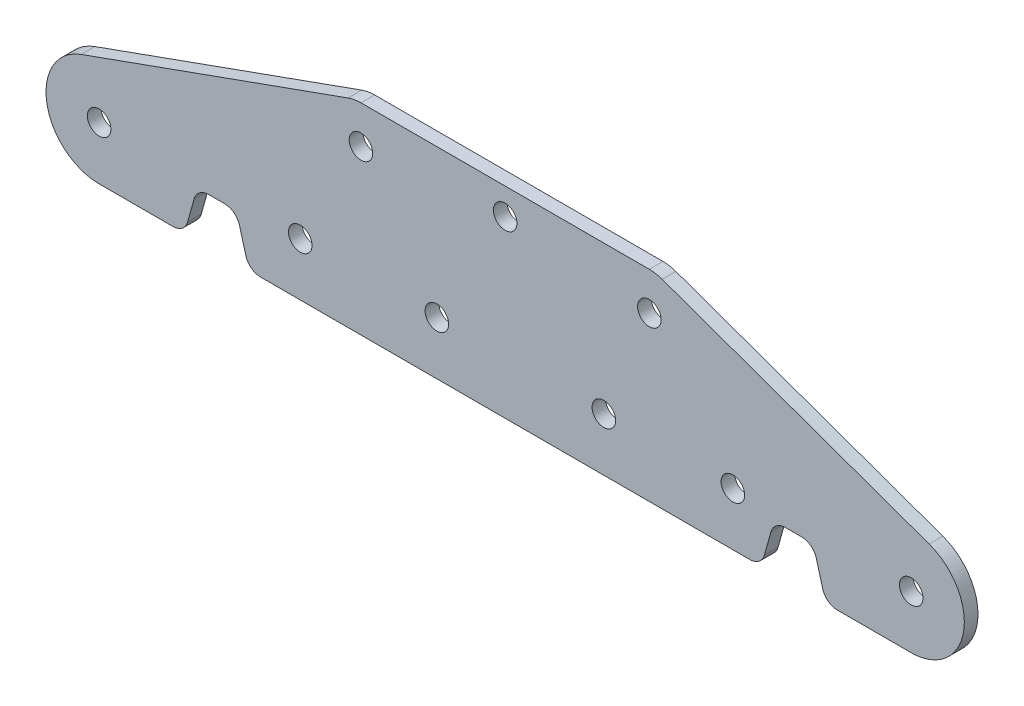
ISO-10303-21;
HEADER;
FILE_DESCRIPTION(('STEP AP214'),'2;1');
FILE_NAME('part.step','',(''),(''),'','','');
FILE_SCHEMA(('AUTOMOTIVE_DESIGN { 1 0 10303 214 1 1 1 1 }'));
ENDSEC;
DATA;
#1=APPLICATION_CONTEXT('core data for automotive mechanical design processes');
#2=APPLICATION_PROTOCOL_DEFINITION('international standard','automotive_design',2000,#1);
#3=PRODUCT_CONTEXT('',#1,'mechanical');
#4=PRODUCT('Part','Part','',(#3));
#5=PRODUCT_RELATED_PRODUCT_CATEGORY('part','',(#4));
#6=PRODUCT_DEFINITION_FORMATION('','',#4);
#7=PRODUCT_DEFINITION_CONTEXT('part definition',#1,'design');
#8=PRODUCT_DEFINITION('design','',#6,#7);
#9=PRODUCT_DEFINITION_SHAPE('','',#8);
#10=(LENGTH_UNIT() NAMED_UNIT(*) SI_UNIT(.MILLI.,.METRE.));
#11=(NAMED_UNIT(*) PLANE_ANGLE_UNIT() SI_UNIT($,.RADIAN.));
#12=(NAMED_UNIT(*) SI_UNIT($,.STERADIAN.) SOLID_ANGLE_UNIT());
#13=UNCERTAINTY_MEASURE_WITH_UNIT(LENGTH_MEASURE(1.E-05),#10,'distance_accuracy_value','');
#14=(GEOMETRIC_REPRESENTATION_CONTEXT(3) GLOBAL_UNCERTAINTY_ASSIGNED_CONTEXT((#13)) GLOBAL_UNIT_ASSIGNED_CONTEXT((#10,
#11,#12)) REPRESENTATION_CONTEXT('',''));
#15=CARTESIAN_POINT('',(0.,0.,0.));
#16=DIRECTION('',(0.,0.,1.));
#17=DIRECTION('',(1.,0.,0.));
#18=AXIS2_PLACEMENT_3D('',#15,#16,#17);
#19=CARTESIAN_POINT('',(5.60213228797349,15.617781870435,1.8));
#20=DIRECTION('',(0.33763778742634,0.941276114910947,0.));
#21=DIRECTION('',(-0.941276114910947,0.33763778742634,0.));
#22=AXIS2_PLACEMENT_3D('',#19,#20,#21);
#23=PLANE('',#22);
#24=DIRECTION('',(0.941276114910947,-0.33763778742634,0.));
#25=VECTOR('',#24,1.);
#26=CARTESIAN_POINT('',(5.60213228797349,15.617781870435,0.));
#27=LINE('',#26,#25);
#28=CARTESIAN_POINT('',(20.6881889371317,10.2063805745547,0.));
#29=VERTEX_POINT('',#28);
#30=CARTESIAN_POINT('',(55.8634645119844,-2.41106719562335,0.));
#31=VERTEX_POINT('',#30);
#32=EDGE_CURVE('E207',#29,#31,#27,.T.);
#33=ORIENTED_EDGE('',*,*,#32,.F.);
#34=DIRECTION('',(0.,0.,-1.));
#35=VECTOR('',#34,1.);
#36=CARTESIAN_POINT('',(20.6881889371317,10.2063805745547,1.8));
#37=LINE('',#36,#35);
#38=CARTESIAN_POINT('',(20.6881889371317,10.2063805745547,1.8));
#39=VERTEX_POINT('',#38);
#40=EDGE_CURVE('E201',#39,#29,#37,.T.);
#41=ORIENTED_EDGE('',*,*,#40,.F.);
#42=DIRECTION('',(0.941276114910947,-0.33763778742634,0.));
#43=VECTOR('',#42,1.);
#44=CARTESIAN_POINT('',(5.60213228797349,15.617781870435,1.8));
#45=LINE('',#44,#43);
#46=CARTESIAN_POINT('',(55.8634645119844,-2.41106719562335,1.8));
#47=VERTEX_POINT('',#46);
#48=EDGE_CURVE('E204',#39,#47,#45,.T.);
#49=ORIENTED_EDGE('',*,*,#48,.T.);
#50=DIRECTION('',(0.,0.,-1.));
#51=VECTOR('',#50,1.);
#52=CARTESIAN_POINT('',(55.8634645119844,-2.41106719562335,1.8));
#53=LINE('',#52,#51);
#54=EDGE_CURVE('E268',#47,#31,#53,.T.);
#55=ORIENTED_EDGE('',*,*,#54,.T.);
#56=EDGE_LOOP('',(#33,#41,#49,#55));
#57=FACE_BOUND('',#56,.T.);
#58=ADVANCED_FACE('F39',(#57),#23,.T.);
#59=CARTESIAN_POINT('',(19.,5.50000000000001,1.8));
#60=DIRECTION('',(0.,0.,-1.));
#61=DIRECTION('',(-1.,0.,0.));
#62=AXIS2_PLACEMENT_3D('',#59,#60,#61);
#63=CYLINDRICAL_SURFACE('',#62,5.);
#64=CARTESIAN_POINT('',(19.,5.50000000000001,0.));
#65=DIRECTION('',(0.,0.,1.));
#66=DIRECTION('',(1.,0.,0.));
#67=AXIS2_PLACEMENT_3D('',#64,#65,#66);
#68=CIRCLE('',#67,5.);
#69=CARTESIAN_POINT('',(19.,10.5,0.));
#70=VERTEX_POINT('',#69);
#71=EDGE_CURVE('E297',#29,#70,#68,.T.);
#72=ORIENTED_EDGE('',*,*,#71,.T.);
#73=DIRECTION('',(0.,0.,-1.));
#74=VECTOR('',#73,1.);
#75=CARTESIAN_POINT('',(19.,10.5,1.8));
#76=LINE('',#75,#74);
#77=CARTESIAN_POINT('',(19.,10.5,1.8));
#78=VERTEX_POINT('',#77);
#79=EDGE_CURVE('E212',#78,#70,#76,.T.);
#80=ORIENTED_EDGE('',*,*,#79,.F.);
#81=CARTESIAN_POINT('',(19.,5.50000000000001,1.8));
#82=DIRECTION('',(0.,0.,1.));
#83=DIRECTION('',(1.,0.,0.));
#84=AXIS2_PLACEMENT_3D('',#81,#82,#83);
#85=CIRCLE('',#84,5.);
#86=EDGE_CURVE('E215',#39,#78,#85,.T.);
#87=ORIENTED_EDGE('',*,*,#86,.F.);
#88=ORIENTED_EDGE('',*,*,#40,.T.);
#89=EDGE_LOOP('',(#72,#80,#87,#88));
#90=FACE_BOUND('',#89,.T.);
#91=ADVANCED_FACE('F216',(#90),#63,.T.);
#92=CARTESIAN_POINT('',(0.,10.5,1.8));
#93=DIRECTION('',(0.,1.,0.));
#94=DIRECTION('',(-1.,0.,0.));
#95=AXIS2_PLACEMENT_3D('',#92,#93,#94);
#96=PLANE('',#95);
#97=DIRECTION('',(1.,0.,0.));
#98=VECTOR('',#97,1.);
#99=CARTESIAN_POINT('',(0.,10.5,0.));
#100=LINE('',#99,#98);
#101=CARTESIAN_POINT('',(-19.,10.5,0.));
#102=VERTEX_POINT('',#101);
#103=EDGE_CURVE('E299',#102,#70,#100,.T.);
#104=ORIENTED_EDGE('',*,*,#103,.F.);
#105=DIRECTION('',(0.,0.,-1.));
#106=VECTOR('',#105,1.);
#107=CARTESIAN_POINT('',(-19.,10.5,1.8));
#108=LINE('',#107,#106);
#109=CARTESIAN_POINT('',(-19.,10.5,1.8));
#110=VERTEX_POINT('',#109);
#111=EDGE_CURVE('E352',#110,#102,#108,.T.);
#112=ORIENTED_EDGE('',*,*,#111,.F.);
#113=DIRECTION('',(1.,0.,0.));
#114=VECTOR('',#113,1.);
#115=CARTESIAN_POINT('',(0.,10.5,1.8));
#116=LINE('',#115,#114);
#117=EDGE_CURVE('E219',#110,#78,#116,.T.);
#118=ORIENTED_EDGE('',*,*,#117,.T.);
#119=ORIENTED_EDGE('',*,*,#79,.T.);
#120=EDGE_LOOP('',(#104,#112,#118,#119));
#121=FACE_BOUND('',#120,.T.);
#122=ADVANCED_FACE('F457',(#121),#96,.T.);
#123=CARTESIAN_POINT('',(-19.,5.5,1.8));
#124=DIRECTION('',(0.,0.,-1.));
#125=DIRECTION('',(-1.,0.,0.));
#126=AXIS2_PLACEMENT_3D('',#123,#124,#125);
#127=CYLINDRICAL_SURFACE('',#126,5.);
#128=CARTESIAN_POINT('',(-19.,5.5,0.));
#129=DIRECTION('',(0.,0.,1.));
#130=DIRECTION('',(1.,0.,0.));
#131=AXIS2_PLACEMENT_3D('',#128,#129,#130);
#132=CIRCLE('',#131,5.);
#133=CARTESIAN_POINT('',(-20.6881889371317,10.2063805745547,0.));
#134=VERTEX_POINT('',#133);
#135=EDGE_CURVE('E302',#134,#102,#132,.F.);
#136=ORIENTED_EDGE('',*,*,#135,.F.);
#137=DIRECTION('',(0.,0.,-1.));
#138=VECTOR('',#137,1.);
#139=CARTESIAN_POINT('',(-20.6881889371317,10.2063805745547,1.8));
#140=LINE('',#139,#138);
#141=CARTESIAN_POINT('',(-20.6881889371317,10.2063805745547,1.8));
#142=VERTEX_POINT('',#141);
#143=EDGE_CURVE('E350',#142,#134,#140,.T.);
#144=ORIENTED_EDGE('',*,*,#143,.F.);
#145=CARTESIAN_POINT('',(-19.,5.5,1.8));
#146=DIRECTION('',(0.,0.,1.));
#147=DIRECTION('',(1.,0.,0.));
#148=AXIS2_PLACEMENT_3D('',#145,#146,#147);
#149=CIRCLE('',#148,5.);
#150=EDGE_CURVE('E233',#142,#110,#149,.F.);
#151=ORIENTED_EDGE('',*,*,#150,.T.);
#152=ORIENTED_EDGE('',*,*,#111,.T.);
#153=EDGE_LOOP('',(#136,#144,#151,#152));
#154=FACE_BOUND('',#153,.T.);
#155=ADVANCED_FACE('F460',(#154),#127,.T.);
#156=CARTESIAN_POINT('',(-5.60213228797349,15.617781870435,1.8));
#157=DIRECTION('',(0.33763778742634,-0.941276114910947,0.));
#158=DIRECTION('',(0.941276114910947,0.33763778742634,0.));
#159=AXIS2_PLACEMENT_3D('',#156,#157,#158);
#160=PLANE('',#159);
#161=DIRECTION('',(-0.941276114910947,-0.33763778742634,0.));
#162=VECTOR('',#161,1.);
#163=CARTESIAN_POINT('',(-5.60213228797349,15.617781870435,0.));
#164=LINE('',#163,#162);
#165=CARTESIAN_POINT('',(-55.8634645119844,-2.41106719562337,0.));
#166=VERTEX_POINT('',#165);
#167=EDGE_CURVE('E305',#134,#166,#164,.T.);
#168=ORIENTED_EDGE('',*,*,#167,.T.);
#169=DIRECTION('',(0.,0.,-1.));
#170=VECTOR('',#169,1.);
#171=CARTESIAN_POINT('',(-55.8634645119844,-2.41106719562337,1.8));
#172=LINE('',#171,#170);
#173=CARTESIAN_POINT('',(-55.8634645119844,-2.41106719562337,1.8));
#174=VERTEX_POINT('',#173);
#175=EDGE_CURVE('E347',#174,#166,#172,.T.);
#176=ORIENTED_EDGE('',*,*,#175,.F.);
#177=DIRECTION('',(-0.941276114910947,-0.33763778742634,0.));
#178=VECTOR('',#177,1.);
#179=CARTESIAN_POINT('',(-5.60213228797349,15.617781870435,1.8));
#180=LINE('',#179,#178);
#181=EDGE_CURVE('E236',#142,#174,#180,.T.);
#182=ORIENTED_EDGE('',*,*,#181,.F.);
#183=ORIENTED_EDGE('',*,*,#143,.T.);
#184=EDGE_LOOP('',(#168,#176,#182,#183));
#185=FACE_BOUND('',#184,.T.);
#186=ADVANCED_FACE('F464',(#185),#160,.F.);
#187=CARTESIAN_POINT('',(-53.5,-9.,1.8));
#188=DIRECTION('',(0.,0.,-1.));
#189=DIRECTION('',(-1.,0.,0.));
#190=AXIS2_PLACEMENT_3D('',#187,#188,#189);
#191=CYLINDRICAL_SURFACE('',#190,7.);
#192=CARTESIAN_POINT('',(-53.5,-9.,0.));
#193=DIRECTION('',(0.,0.,1.));
#194=DIRECTION('',(1.,0.,0.));
#195=AXIS2_PLACEMENT_3D('',#192,#193,#194);
#196=CIRCLE('',#195,7.);
#197=CARTESIAN_POINT('',(-53.5,-16.,0.));
#198=VERTEX_POINT('',#197);
#199=EDGE_CURVE('E308',#166,#198,#196,.T.);
#200=ORIENTED_EDGE('',*,*,#199,.T.);
#201=DIRECTION('',(0.,0.,-1.));
#202=VECTOR('',#201,1.);
#203=CARTESIAN_POINT('',(-53.5,-16.,1.8));
#204=LINE('',#203,#202);
#205=CARTESIAN_POINT('',(-53.5,-16.,1.8));
#206=VERTEX_POINT('',#205);
#207=EDGE_CURVE('E344',#206,#198,#204,.T.);
#208=ORIENTED_EDGE('',*,*,#207,.F.);
#209=CARTESIAN_POINT('',(-53.5,-9.,1.8));
#210=DIRECTION('',(0.,0.,1.));
#211=DIRECTION('',(1.,0.,0.));
#212=AXIS2_PLACEMENT_3D('',#209,#210,#211);
#213=CIRCLE('',#212,7.);
#214=EDGE_CURVE('E239',#174,#206,#213,.T.);
#215=ORIENTED_EDGE('',*,*,#214,.F.);
#216=ORIENTED_EDGE('',*,*,#175,.T.);
#217=EDGE_LOOP('',(#200,#208,#215,#216));
#218=FACE_BOUND('',#217,.T.);
#219=ADVANCED_FACE('F468',(#218),#191,.T.);
#220=CARTESIAN_POINT('',(0.,-16.,1.8));
#221=DIRECTION('',(0.,1.,0.));
#222=DIRECTION('',(0.,0.,1.));
#223=AXIS2_PLACEMENT_3D('',#220,#221,#222);
#224=PLANE('',#223);
#225=DIRECTION('',(1.,0.,0.));
#226=VECTOR('',#225,1.);
#227=CARTESIAN_POINT('',(0.,-16.,0.));
#228=LINE('',#227,#226);
#229=CARTESIAN_POINT('',(-43.7685396728729,-16.,0.));
#230=VERTEX_POINT('',#229);
#231=EDGE_CURVE('E311',#198,#230,#228,.T.);
#232=ORIENTED_EDGE('',*,*,#231,.T.);
#233=DIRECTION('',(0.,0.,-1.));
#234=VECTOR('',#233,1.);
#235=CARTESIAN_POINT('',(-43.7685396728729,-16.,1.8));
#236=LINE('',#235,#234);
#237=CARTESIAN_POINT('',(-43.7685396728729,-16.,1.8));
#238=VERTEX_POINT('',#237);
#239=EDGE_CURVE('E389',#230,#238,#236,.F.);
#240=ORIENTED_EDGE('',*,*,#239,.T.);
#241=DIRECTION('',(1.,0.,0.));
#242=VECTOR('',#241,1.);
#243=CARTESIAN_POINT('',(0.,-16.,1.8));
#244=LINE('',#243,#242);
#245=EDGE_CURVE('E242',#206,#238,#244,.T.);
#246=ORIENTED_EDGE('',*,*,#245,.F.);
#247=ORIENTED_EDGE('',*,*,#207,.T.);
#248=EDGE_LOOP('',(#232,#240,#246,#247));
#249=FACE_BOUND('',#248,.T.);
#250=ADVANCED_FACE('F470',(#249),#224,.F.);
#251=CARTESIAN_POINT('',(-35.0606656720266,9.77815646453531,1.8));
#252=DIRECTION('',(0.963240498520991,-0.268640544239011,0.));
#253=DIRECTION('',(0.268640544239011,0.963240498520991,0.));
#254=AXIS2_PLACEMENT_3D('',#251,#252,#253);
#255=PLANE('',#254);
#256=DIRECTION('',(-0.268640544239011,-0.963240498520991,0.));
#257=VECTOR('',#256,1.);
#258=CARTESIAN_POINT('',(-35.0606656720266,9.77815646453531,1.8));
#259=LINE('',#258,#257);
#260=CARTESIAN_POINT('',(-40.9845863646248,-11.462718911522,1.8));
#261=VERTEX_POINT('',#260);
#262=CARTESIAN_POINT('',(-41.8420586758309,-14.537281088478,1.8));
#263=VERTEX_POINT('',#262);
#264=EDGE_CURVE('E245',#261,#263,#259,.T.);
#265=ORIENTED_EDGE('',*,*,#264,.T.);
#266=DIRECTION('',(0.,0.,-1.));
#267=VECTOR('',#266,1.);
#268=CARTESIAN_POINT('',(-41.8420586758309,-14.537281088478,0.));
#269=LINE('',#268,#267);
#270=CARTESIAN_POINT('',(-41.8420586758309,-14.537281088478,0.));
#271=VERTEX_POINT('',#270);
#272=EDGE_CURVE('E386',#263,#271,#269,.T.);
#273=ORIENTED_EDGE('',*,*,#272,.T.);
#274=DIRECTION('',(-0.268640544239011,-0.963240498520991,0.));
#275=VECTOR('',#274,1.);
#276=CARTESIAN_POINT('',(-35.0606656720266,9.77815646453531,0.));
#277=LINE('',#276,#275);
#278=CARTESIAN_POINT('',(-40.9845863646248,-11.462718911522,0.));
#279=VERTEX_POINT('',#278);
#280=EDGE_CURVE('E314',#279,#271,#277,.T.);
#281=ORIENTED_EDGE('',*,*,#280,.F.);
#282=DIRECTION('',(0.,0.,-1.));
#283=VECTOR('',#282,1.);
#284=CARTESIAN_POINT('',(-40.9845863646248,-11.462718911522,1.8));
#285=LINE('',#284,#283);
#286=EDGE_CURVE('E384',#279,#261,#285,.F.);
#287=ORIENTED_EDGE('',*,*,#286,.T.);
#288=EDGE_LOOP('',(#265,#273,#281,#287));
#289=FACE_BOUND('',#288,.T.);
#290=ADVANCED_FACE('F478',(#289),#255,.T.);
#291=CARTESIAN_POINT('',(0.,-9.99999999999999,1.8));
#292=DIRECTION('',(0.,-1.,0.));
#293=DIRECTION('',(1.,0.,0.));
#294=AXIS2_PLACEMENT_3D('',#291,#292,#293);
#295=PLANE('',#294);
#296=DIRECTION('',(-1.,0.,0.));
#297=VECTOR('',#296,1.);
#298=CARTESIAN_POINT('',(0.,-9.99999999999999,0.));
#299=LINE('',#298,#297);
#300=CARTESIAN_POINT('',(-36.9418946324172,-10.,0.));
#301=VERTEX_POINT('',#300);
#302=CARTESIAN_POINT('',(-39.0581053675828,-10.,0.));
#303=VERTEX_POINT('',#302);
#304=EDGE_CURVE('E317',#301,#303,#299,.T.);
#305=ORIENTED_EDGE('',*,*,#304,.F.);
#306=DIRECTION('',(0.,0.,-1.));
#307=VECTOR('',#306,1.);
#308=CARTESIAN_POINT('',(-36.9418946324172,-10.,1.8));
#309=LINE('',#308,#307);
#310=CARTESIAN_POINT('',(-36.9418946324172,-10.,1.8));
#311=VERTEX_POINT('',#310);
#312=EDGE_CURVE('E382',#301,#311,#309,.F.);
#313=ORIENTED_EDGE('',*,*,#312,.T.);
#314=DIRECTION('',(-1.,0.,0.));
#315=VECTOR('',#314,1.);
#316=CARTESIAN_POINT('',(0.,-9.99999999999999,1.8));
#317=LINE('',#316,#315);
#318=CARTESIAN_POINT('',(-39.0581053675828,-10.,1.8));
#319=VERTEX_POINT('',#318);
#320=EDGE_CURVE('E248',#311,#319,#317,.T.);
#321=ORIENTED_EDGE('',*,*,#320,.T.);
#322=DIRECTION('',(0.,0.,-1.));
#323=VECTOR('',#322,1.);
#324=CARTESIAN_POINT('',(-39.0581053675828,-10.,0.));
#325=LINE('',#324,#323);
#326=EDGE_CURVE('E379',#319,#303,#325,.T.);
#327=ORIENTED_EDGE('',*,*,#326,.T.);
#328=EDGE_LOOP('',(#305,#313,#321,#327));
#329=FACE_BOUND('',#328,.T.);
#330=ADVANCED_FACE('F488',(#329),#295,.T.);
#331=CARTESIAN_POINT('',(-35.4545859352869,-9.88801786890059,1.8));
#332=DIRECTION('',(-0.963240498520991,-0.268640544239011,0.));
#333=DIRECTION('',(0.268640544239011,-0.963240498520991,0.));
#334=AXIS2_PLACEMENT_3D('',#331,#332,#333);
#335=PLANE('',#334);
#336=DIRECTION('',(-0.268640544239011,0.963240498520991,0.));
#337=VECTOR('',#336,1.);
#338=CARTESIAN_POINT('',(-35.4545859352869,-9.88801786890059,0.));
#339=LINE('',#338,#337);
#340=CARTESIAN_POINT('',(-34.1579413241691,-14.537281088478,0.));
#341=VERTEX_POINT('',#340);
#342=CARTESIAN_POINT('',(-35.0154136353752,-11.462718911522,0.));
#343=VERTEX_POINT('',#342);
#344=EDGE_CURVE('E320',#341,#343,#339,.T.);
#345=ORIENTED_EDGE('',*,*,#344,.F.);
#346=DIRECTION('',(0.,0.,-1.));
#347=VECTOR('',#346,1.);
#348=CARTESIAN_POINT('',(-34.1579413241691,-14.537281088478,1.8));
#349=LINE('',#348,#347);
#350=CARTESIAN_POINT('',(-34.1579413241691,-14.537281088478,1.8));
#351=VERTEX_POINT('',#350);
#352=EDGE_CURVE('E370',#341,#351,#349,.F.);
#353=ORIENTED_EDGE('',*,*,#352,.T.);
#354=DIRECTION('',(-0.268640544239011,0.963240498520991,0.));
#355=VECTOR('',#354,1.);
#356=CARTESIAN_POINT('',(-35.4545859352869,-9.88801786890059,1.8));
#357=LINE('',#356,#355);
#358=CARTESIAN_POINT('',(-35.0154136353752,-11.462718911522,1.8));
#359=VERTEX_POINT('',#358);
#360=EDGE_CURVE('E251',#351,#359,#357,.T.);
#361=ORIENTED_EDGE('',*,*,#360,.T.);
#362=DIRECTION('',(0.,0.,-1.));
#363=VECTOR('',#362,1.);
#364=CARTESIAN_POINT('',(-35.0154136353752,-11.462718911522,0.));
#365=LINE('',#364,#363);
#366=EDGE_CURVE('E367',#359,#343,#365,.T.);
#367=ORIENTED_EDGE('',*,*,#366,.T.);
#368=EDGE_LOOP('',(#345,#353,#361,#367));
#369=FACE_BOUND('',#368,.T.);
#370=ADVANCED_FACE('F496',(#369),#335,.T.);
#371=CARTESIAN_POINT('',(0.,-16.,1.8));
#372=DIRECTION('',(0.,1.,0.));
#373=DIRECTION('',(-1.,0.,0.));
#374=AXIS2_PLACEMENT_3D('',#371,#372,#373);
#375=PLANE('',#374);
#376=DIRECTION('',(1.,0.,0.));
#377=VECTOR('',#376,1.);
#378=CARTESIAN_POINT('',(0.,-16.,1.8));
#379=LINE('',#378,#377);
#380=CARTESIAN_POINT('',(-32.2314603271271,-16.,1.8));
#381=VERTEX_POINT('',#380);
#382=CARTESIAN_POINT('',(32.2314603271271,-16.,1.8));
#383=VERTEX_POINT('',#382);
#384=EDGE_CURVE('E254',#381,#383,#379,.T.);
#385=ORIENTED_EDGE('',*,*,#384,.F.);
#386=DIRECTION('',(0.,0.,-1.));
#387=VECTOR('',#386,1.);
#388=CARTESIAN_POINT('',(-32.2314603271271,-16.,0.));
#389=LINE('',#388,#387);
#390=CARTESIAN_POINT('',(-32.2314603271271,-16.,0.));
#391=VERTEX_POINT('',#390);
#392=EDGE_CURVE('E356',#381,#391,#389,.T.);
#393=ORIENTED_EDGE('',*,*,#392,.T.);
#394=DIRECTION('',(1.,0.,0.));
#395=VECTOR('',#394,1.);
#396=CARTESIAN_POINT('',(0.,-16.,0.));
#397=LINE('',#396,#395);
#398=CARTESIAN_POINT('',(32.2314603271271,-16.,0.));
#399=VERTEX_POINT('',#398);
#400=EDGE_CURVE('E323',#391,#399,#397,.T.);
#401=ORIENTED_EDGE('',*,*,#400,.T.);
#402=DIRECTION('',(0.,0.,-1.));
#403=VECTOR('',#402,1.);
#404=CARTESIAN_POINT('',(32.2314603271271,-16.,1.8));
#405=LINE('',#404,#403);
#406=EDGE_CURVE('E211',#399,#383,#405,.F.);
#407=ORIENTED_EDGE('',*,*,#406,.T.);
#408=EDGE_LOOP('',(#385,#393,#401,#407));
#409=FACE_BOUND('',#408,.T.);
#410=ADVANCED_FACE('F504',(#409),#375,.F.);
#411=CARTESIAN_POINT('',(35.4545859352869,-9.88801786890058,1.8));
#412=DIRECTION('',(-0.963240498520991,0.268640544239011,0.));
#413=DIRECTION('',(-0.268640544239011,-0.963240498520991,0.));
#414=AXIS2_PLACEMENT_3D('',#411,#412,#413);
#415=PLANE('',#414);
#416=DIRECTION('',(0.268640544239011,0.963240498520991,0.));
#417=VECTOR('',#416,1.);
#418=CARTESIAN_POINT('',(35.4545859352869,-9.88801786890058,0.));
#419=LINE('',#418,#417);
#420=CARTESIAN_POINT('',(34.1579413241691,-14.537281088478,0.));
#421=VERTEX_POINT('',#420);
#422=CARTESIAN_POINT('',(35.0154136353752,-11.462718911522,0.));
#423=VERTEX_POINT('',#422);
#424=EDGE_CURVE('E326',#421,#423,#419,.T.);
#425=ORIENTED_EDGE('',*,*,#424,.T.);
#426=DIRECTION('',(0.,0.,-1.));
#427=VECTOR('',#426,1.);
#428=CARTESIAN_POINT('',(35.0154136353752,-11.462718911522,1.8));
#429=LINE('',#428,#427);
#430=CARTESIAN_POINT('',(35.0154136353752,-11.462718911522,1.8));
#431=VERTEX_POINT('',#430);
#432=EDGE_CURVE('E406',#423,#431,#429,.F.);
#433=ORIENTED_EDGE('',*,*,#432,.T.);
#434=DIRECTION('',(0.268640544239011,0.963240498520991,0.));
#435=VECTOR('',#434,1.);
#436=CARTESIAN_POINT('',(35.4545859352869,-9.88801786890058,1.8));
#437=LINE('',#436,#435);
#438=CARTESIAN_POINT('',(34.1579413241691,-14.537281088478,1.8));
#439=VERTEX_POINT('',#438);
#440=EDGE_CURVE('E257',#439,#431,#437,.T.);
#441=ORIENTED_EDGE('',*,*,#440,.F.);
#442=DIRECTION('',(0.,0.,-1.));
#443=VECTOR('',#442,1.);
#444=CARTESIAN_POINT('',(34.1579413241691,-14.537281088478,1.8));
#445=LINE('',#444,#443);
#446=EDGE_CURVE('E403',#439,#421,#445,.T.);
#447=ORIENTED_EDGE('',*,*,#446,.T.);
#448=EDGE_LOOP('',(#425,#433,#441,#447));
#449=FACE_BOUND('',#448,.T.);
#450=ADVANCED_FACE('F428',(#449),#415,.F.);
#451=CARTESIAN_POINT('',(0.,-9.99999999999999,1.8));
#452=DIRECTION('',(0.,1.,0.));
#453=DIRECTION('',(0.,0.,1.));
#454=AXIS2_PLACEMENT_3D('',#451,#452,#453);
#455=PLANE('',#454);
#456=DIRECTION('',(1.,0.,0.));
#457=VECTOR('',#456,1.);
#458=CARTESIAN_POINT('',(0.,-9.99999999999999,0.));
#459=LINE('',#458,#457);
#460=CARTESIAN_POINT('',(36.9418946324172,-9.99999999999999,0.));
#461=VERTEX_POINT('',#460);
#462=CARTESIAN_POINT('',(39.0581053675828,-9.99999999999999,0.));
#463=VERTEX_POINT('',#462);
#464=EDGE_CURVE('E329',#461,#463,#459,.T.);
#465=ORIENTED_EDGE('',*,*,#464,.T.);
#466=DIRECTION('',(0.,0.,-1.));
#467=VECTOR('',#466,1.);
#468=CARTESIAN_POINT('',(39.0581053675828,-9.99999999999999,1.8));
#469=LINE('',#468,#467);
#470=CARTESIAN_POINT('',(39.0581053675828,-9.99999999999999,1.8));
#471=VERTEX_POINT('',#470);
#472=EDGE_CURVE('E401',#463,#471,#469,.F.);
#473=ORIENTED_EDGE('',*,*,#472,.T.);
#474=DIRECTION('',(1.,0.,0.));
#475=VECTOR('',#474,1.);
#476=CARTESIAN_POINT('',(0.,-9.99999999999999,1.8));
#477=LINE('',#476,#475);
#478=CARTESIAN_POINT('',(36.9418946324172,-9.99999999999999,1.8));
#479=VERTEX_POINT('',#478);
#480=EDGE_CURVE('E260',#479,#471,#477,.T.);
#481=ORIENTED_EDGE('',*,*,#480,.F.);
#482=DIRECTION('',(0.,0.,-1.));
#483=VECTOR('',#482,1.);
#484=CARTESIAN_POINT('',(36.9418946324172,-9.99999999999999,0.));
#485=LINE('',#484,#483);
#486=EDGE_CURVE('E398',#479,#461,#485,.T.);
#487=ORIENTED_EDGE('',*,*,#486,.T.);
#488=EDGE_LOOP('',(#465,#473,#481,#487));
#489=FACE_BOUND('',#488,.T.);
#490=ADVANCED_FACE('F436',(#489),#455,.F.);
#491=CARTESIAN_POINT('',(35.0606656720266,9.77815646453531,1.8));
#492=DIRECTION('',(0.963240498520991,0.268640544239011,0.));
#493=DIRECTION('',(-0.268640544239011,0.963240498520991,0.));
#494=AXIS2_PLACEMENT_3D('',#491,#492,#493);
#495=PLANE('',#494);
#496=DIRECTION('',(0.268640544239011,-0.963240498520991,0.));
#497=VECTOR('',#496,1.);
#498=CARTESIAN_POINT('',(35.0606656720266,9.77815646453531,0.));
#499=LINE('',#498,#497);
#500=CARTESIAN_POINT('',(40.9845863646248,-11.462718911522,0.));
#501=VERTEX_POINT('',#500);
#502=CARTESIAN_POINT('',(41.8420586758309,-14.537281088478,0.));
#503=VERTEX_POINT('',#502);
#504=EDGE_CURVE('E332',#501,#503,#499,.T.);
#505=ORIENTED_EDGE('',*,*,#504,.T.);
#506=DIRECTION('',(0.,0.,-1.));
#507=VECTOR('',#506,1.);
#508=CARTESIAN_POINT('',(41.8420586758309,-14.537281088478,1.8));
#509=LINE('',#508,#507);
#510=CARTESIAN_POINT('',(41.8420586758309,-14.537281088478,1.8));
#511=VERTEX_POINT('',#510);
#512=EDGE_CURVE('E62',#503,#511,#509,.F.);
#513=ORIENTED_EDGE('',*,*,#512,.T.);
#514=DIRECTION('',(0.268640544239011,-0.963240498520991,0.));
#515=VECTOR('',#514,1.);
#516=CARTESIAN_POINT('',(35.0606656720266,9.77815646453531,1.8));
#517=LINE('',#516,#515);
#518=CARTESIAN_POINT('',(40.9845863646248,-11.462718911522,1.8));
#519=VERTEX_POINT('',#518);
#520=EDGE_CURVE('E263',#519,#511,#517,.T.);
#521=ORIENTED_EDGE('',*,*,#520,.F.);
#522=DIRECTION('',(0.,0.,-1.));
#523=VECTOR('',#522,1.);
#524=CARTESIAN_POINT('',(40.9845863646248,-11.462718911522,0.));
#525=LINE('',#524,#523);
#526=EDGE_CURVE('E394',#519,#501,#525,.T.);
#527=ORIENTED_EDGE('',*,*,#526,.T.);
#528=EDGE_LOOP('',(#505,#513,#521,#527));
#529=FACE_BOUND('',#528,.T.);
#530=ADVANCED_FACE('F441',(#529),#495,.F.);
#531=CARTESIAN_POINT('',(0.,-16.,1.8));
#532=DIRECTION('',(0.,1.,0.));
#533=DIRECTION('',(-1.,0.,0.));
#534=AXIS2_PLACEMENT_3D('',#531,#532,#533);
#535=PLANE('',#534);
#536=DIRECTION('',(1.,0.,0.));
#537=VECTOR('',#536,1.);
#538=CARTESIAN_POINT('',(0.,-16.,1.8));
#539=LINE('',#538,#537);
#540=CARTESIAN_POINT('',(43.7685396728729,-16.,1.8));
#541=VERTEX_POINT('',#540);
#542=CARTESIAN_POINT('',(53.5,-16.,1.8));
#543=VERTEX_POINT('',#542);
#544=EDGE_CURVE('E265',#541,#543,#539,.T.);
#545=ORIENTED_EDGE('',*,*,#544,.F.);
#546=DIRECTION('',(0.,0.,-1.));
#547=VECTOR('',#546,1.);
#548=CARTESIAN_POINT('',(43.7685396728729,-16.,1.8));
#549=LINE('',#548,#547);
#550=CARTESIAN_POINT('',(43.7685396728729,-16.,0.));
#551=VERTEX_POINT('',#550);
#552=EDGE_CURVE('E391',#541,#551,#549,.T.);
#553=ORIENTED_EDGE('',*,*,#552,.T.);
#554=DIRECTION('',(1.,0.,0.));
#555=VECTOR('',#554,1.);
#556=CARTESIAN_POINT('',(0.,-16.,0.));
#557=LINE('',#556,#555);
#558=CARTESIAN_POINT('',(53.5,-16.,0.));
#559=VERTEX_POINT('',#558);
#560=EDGE_CURVE('E334',#551,#559,#557,.T.);
#561=ORIENTED_EDGE('',*,*,#560,.T.);
#562=DIRECTION('',(0.,0.,-1.));
#563=VECTOR('',#562,1.);
#564=CARTESIAN_POINT('',(53.5,-16.,1.8));
#565=LINE('',#564,#563);
#566=EDGE_CURVE('E341',#543,#559,#565,.T.);
#567=ORIENTED_EDGE('',*,*,#566,.F.);
#568=EDGE_LOOP('',(#545,#553,#561,#567));
#569=FACE_BOUND('',#568,.T.);
#570=ADVANCED_FACE('F448',(#569),#535,.F.);
#571=CARTESIAN_POINT('',(19.,5.50000000000001,1.8));
#572=DIRECTION('',(0.,0.,-1.));
#573=DIRECTION('',(-1.,0.,0.));
#574=AXIS2_PLACEMENT_3D('',#571,#572,#573);
#575=CYLINDRICAL_SURFACE('',#574,1.55);
#576=CARTESIAN_POINT('',(19.,5.50000000000001,1.8));
#577=DIRECTION('',(0.,0.,1.));
#578=DIRECTION('',(1.,0.,0.));
#579=AXIS2_PLACEMENT_3D('',#576,#577,#578);
#580=CIRCLE('',#579,1.55);
#581=CARTESIAN_POINT('',(20.55,5.50000000000001,1.8));
#582=VERTEX_POINT('',#581);
#583=EDGE_CURVE('E225',#582,#582,#580,.T.);
#584=ORIENTED_EDGE('',*,*,#583,.T.);
#585=EDGE_LOOP('',(#584));
#586=FACE_BOUND('',#585,.T.);
#587=CARTESIAN_POINT('',(19.,5.50000000000001,0.));
#588=DIRECTION('',(0.,0.,1.));
#589=DIRECTION('',(1.,0.,0.));
#590=AXIS2_PLACEMENT_3D('',#587,#588,#589);
#591=CIRCLE('',#590,1.55);
#592=CARTESIAN_POINT('',(20.55,5.50000000000001,0.));
#593=VERTEX_POINT('',#592);
#594=EDGE_CURVE('E293',#593,#593,#591,.T.);
#595=ORIENTED_EDGE('',*,*,#594,.F.);
#596=EDGE_LOOP('',(#595));
#597=FACE_BOUND('',#596,.T.);
#598=ADVANCED_FACE('F519',(#586,#597),#575,.F.);
#599=CARTESIAN_POINT('',(-19.,5.5,1.8));
#600=DIRECTION('',(0.,0.,-1.));
#601=DIRECTION('',(-1.,0.,0.));
#602=AXIS2_PLACEMENT_3D('',#599,#600,#601);
#603=CYLINDRICAL_SURFACE('',#602,1.55);
#604=CARTESIAN_POINT('',(-19.,5.5,1.8));
#605=DIRECTION('',(0.,0.,1.));
#606=DIRECTION('',(1.,0.,0.));
#607=AXIS2_PLACEMENT_3D('',#604,#605,#606);
#608=CIRCLE('',#607,1.55);
#609=CARTESIAN_POINT('',(-17.45,5.5,1.8));
#610=VERTEX_POINT('',#609);
#611=EDGE_CURVE('E228',#610,#610,#608,.T.);
#612=ORIENTED_EDGE('',*,*,#611,.T.);
#613=EDGE_LOOP('',(#612));
#614=FACE_BOUND('',#613,.T.);
#615=CARTESIAN_POINT('',(-19.,5.5,0.));
#616=DIRECTION('',(0.,0.,1.));
#617=DIRECTION('',(1.,0.,0.));
#618=AXIS2_PLACEMENT_3D('',#615,#616,#617);
#619=CIRCLE('',#618,1.55);
#620=CARTESIAN_POINT('',(-17.45,5.5,0.));
#621=VERTEX_POINT('',#620);
#622=EDGE_CURVE('E290',#621,#621,#619,.T.);
#623=ORIENTED_EDGE('',*,*,#622,.F.);
#624=EDGE_LOOP('',(#623));
#625=FACE_BOUND('',#624,.T.);
#626=ADVANCED_FACE('F522',(#614,#625),#603,.F.);
#627=CARTESIAN_POINT('',(-27.,-9.,1.8));
#628=DIRECTION('',(0.,0.,-1.));
#629=DIRECTION('',(-1.,0.,0.));
#630=AXIS2_PLACEMENT_3D('',#627,#628,#629);
#631=CYLINDRICAL_SURFACE('',#630,1.55);
#632=CARTESIAN_POINT('',(-27.,-9.,1.8));
#633=DIRECTION('',(0.,0.,1.));
#634=DIRECTION('',(1.,0.,0.));
#635=AXIS2_PLACEMENT_3D('',#632,#633,#634);
#636=CIRCLE('',#635,1.55);
#637=CARTESIAN_POINT('',(-25.45,-9.,1.8));
#638=VERTEX_POINT('',#637);
#639=EDGE_CURVE('E831',#638,#638,#636,.T.);
#640=ORIENTED_EDGE('',*,*,#639,.T.);
#641=EDGE_LOOP('',(#640));
#642=FACE_BOUND('',#641,.T.);
#643=CARTESIAN_POINT('',(-27.,-9.,0.));
#644=DIRECTION('',(0.,0.,1.));
#645=DIRECTION('',(1.,0.,0.));
#646=AXIS2_PLACEMENT_3D('',#643,#644,#645);
#647=CIRCLE('',#646,1.55);
#648=CARTESIAN_POINT('',(-25.45,-9.,0.));
#649=VERTEX_POINT('',#648);
#650=EDGE_CURVE('E287',#649,#649,#647,.T.);
#651=ORIENTED_EDGE('',*,*,#650,.F.);
#652=EDGE_LOOP('',(#651));
#653=FACE_BOUND('',#652,.T.);
#654=ADVANCED_FACE('F526',(#642,#653),#631,.F.);
#655=CARTESIAN_POINT('',(-9.,-9.,1.8));
#656=DIRECTION('',(0.,0.,-1.));
#657=DIRECTION('',(-1.,0.,0.));
#658=AXIS2_PLACEMENT_3D('',#655,#656,#657);
#659=CYLINDRICAL_SURFACE('',#658,1.55);
#660=CARTESIAN_POINT('',(-9.,-9.,1.8));
#661=DIRECTION('',(0.,0.,1.));
#662=DIRECTION('',(1.,0.,0.));
#663=AXIS2_PLACEMENT_3D('',#660,#661,#662);
#664=CIRCLE('',#663,1.55);
#665=CARTESIAN_POINT('',(-7.45,-9.,1.8));
#666=VERTEX_POINT('',#665);
#667=EDGE_CURVE('E827',#666,#666,#664,.T.);
#668=ORIENTED_EDGE('',*,*,#667,.T.);
#669=EDGE_LOOP('',(#668));
#670=FACE_BOUND('',#669,.T.);
#671=CARTESIAN_POINT('',(-9.,-9.,0.));
#672=DIRECTION('',(0.,0.,1.));
#673=DIRECTION('',(1.,0.,0.));
#674=AXIS2_PLACEMENT_3D('',#671,#672,#673);
#675=CIRCLE('',#674,1.55);
#676=CARTESIAN_POINT('',(-7.45,-9.,0.));
#677=VERTEX_POINT('',#676);
#678=EDGE_CURVE('E284',#677,#677,#675,.T.);
#679=ORIENTED_EDGE('',*,*,#678,.F.);
#680=EDGE_LOOP('',(#679));
#681=FACE_BOUND('',#680,.T.);
#682=ADVANCED_FACE('F530',(#670,#681),#659,.F.);
#683=CARTESIAN_POINT('',(13.,-9.,1.8));
#684=DIRECTION('',(0.,0.,-1.));
#685=DIRECTION('',(-1.,0.,0.));
#686=AXIS2_PLACEMENT_3D('',#683,#684,#685);
#687=CYLINDRICAL_SURFACE('',#686,1.55);
#688=CARTESIAN_POINT('',(13.,-9.,1.8));
#689=DIRECTION('',(0.,0.,1.));
#690=DIRECTION('',(1.,0.,0.));
#691=AXIS2_PLACEMENT_3D('',#688,#689,#690);
#692=CIRCLE('',#691,1.55);
#693=CARTESIAN_POINT('',(14.55,-9.,1.8));
#694=VERTEX_POINT('',#693);
#695=EDGE_CURVE('E823',#694,#694,#692,.T.);
#696=ORIENTED_EDGE('',*,*,#695,.T.);
#697=EDGE_LOOP('',(#696));
#698=FACE_BOUND('',#697,.T.);
#699=CARTESIAN_POINT('',(13.,-9.,0.));
#700=DIRECTION('',(0.,0.,1.));
#701=DIRECTION('',(1.,0.,0.));
#702=AXIS2_PLACEMENT_3D('',#699,#700,#701);
#703=CIRCLE('',#702,1.55);
#704=CARTESIAN_POINT('',(14.55,-9.,0.));
#705=VERTEX_POINT('',#704);
#706=EDGE_CURVE('E281',#705,#705,#703,.T.);
#707=ORIENTED_EDGE('',*,*,#706,.F.);
#708=EDGE_LOOP('',(#707));
#709=FACE_BOUND('',#708,.T.);
#710=ADVANCED_FACE('F534',(#698,#709),#687,.F.);
#711=CARTESIAN_POINT('',(30.,-9.00000000000001,1.8));
#712=DIRECTION('',(0.,0.,-1.));
#713=DIRECTION('',(-1.,0.,0.));
#714=AXIS2_PLACEMENT_3D('',#711,#712,#713);
#715=CYLINDRICAL_SURFACE('',#714,1.55);
#716=CARTESIAN_POINT('',(30.,-9.00000000000001,1.8));
#717=DIRECTION('',(0.,0.,1.));
#718=DIRECTION('',(1.,0.,0.));
#719=AXIS2_PLACEMENT_3D('',#716,#717,#718);
#720=CIRCLE('',#719,1.55);
#721=CARTESIAN_POINT('',(31.55,-9.00000000000001,1.8));
#722=VERTEX_POINT('',#721);
#723=EDGE_CURVE('E819',#722,#722,#720,.T.);
#724=ORIENTED_EDGE('',*,*,#723,.T.);
#725=EDGE_LOOP('',(#724));
#726=FACE_BOUND('',#725,.T.);
#727=CARTESIAN_POINT('',(30.,-9.00000000000001,0.));
#728=DIRECTION('',(0.,0.,1.));
#729=DIRECTION('',(1.,0.,0.));
#730=AXIS2_PLACEMENT_3D('',#727,#728,#729);
#731=CIRCLE('',#730,1.55);
#732=CARTESIAN_POINT('',(31.55,-9.00000000000001,0.));
#733=VERTEX_POINT('',#732);
#734=EDGE_CURVE('E278',#733,#733,#731,.T.);
#735=ORIENTED_EDGE('',*,*,#734,.F.);
#736=EDGE_LOOP('',(#735));
#737=FACE_BOUND('',#736,.T.);
#738=ADVANCED_FACE('F538',(#726,#737),#715,.F.);
#739=CARTESIAN_POINT('',(0.,7.,1.8));
#740=DIRECTION('',(0.,0.,-1.));
#741=DIRECTION('',(-1.,0.,0.));
#742=AXIS2_PLACEMENT_3D('',#739,#740,#741);
#743=CYLINDRICAL_SURFACE('',#742,1.55);
#744=CARTESIAN_POINT('',(0.,7.,1.8));
#745=DIRECTION('',(0.,0.,1.));
#746=DIRECTION('',(1.,0.,0.));
#747=AXIS2_PLACEMENT_3D('',#744,#745,#746);
#748=CIRCLE('',#747,1.55);
#749=CARTESIAN_POINT('',(1.55,7.,1.8));
#750=VERTEX_POINT('',#749);
#751=EDGE_CURVE('E815',#750,#750,#748,.T.);
#752=ORIENTED_EDGE('',*,*,#751,.T.);
#753=EDGE_LOOP('',(#752));
#754=FACE_BOUND('',#753,.T.);
#755=CARTESIAN_POINT('',(0.,7.,0.));
#756=DIRECTION('',(0.,0.,1.));
#757=DIRECTION('',(1.,0.,0.));
#758=AXIS2_PLACEMENT_3D('',#755,#756,#757);
#759=CIRCLE('',#758,1.55);
#760=CARTESIAN_POINT('',(1.55,7.,0.));
#761=VERTEX_POINT('',#760);
#762=EDGE_CURVE('E275',#761,#761,#759,.T.);
#763=ORIENTED_EDGE('',*,*,#762,.F.);
#764=EDGE_LOOP('',(#763));
#765=FACE_BOUND('',#764,.T.);
#766=ADVANCED_FACE('F542',(#754,#765),#743,.F.);
#767=CARTESIAN_POINT('',(-53.5,-9.,1.8));
#768=DIRECTION('',(0.,0.,-1.));
#769=DIRECTION('',(-1.,0.,0.));
#770=AXIS2_PLACEMENT_3D('',#767,#768,#769);
#771=CYLINDRICAL_SURFACE('',#770,1.55);
#772=CARTESIAN_POINT('',(-53.5,-9.,1.8));
#773=DIRECTION('',(0.,0.,1.));
#774=DIRECTION('',(1.,0.,0.));
#775=AXIS2_PLACEMENT_3D('',#772,#773,#774);
#776=CIRCLE('',#775,1.55);
#777=CARTESIAN_POINT('',(-51.95,-9.,1.8));
#778=VERTEX_POINT('',#777);
#779=EDGE_CURVE('E811',#778,#778,#776,.T.);
#780=ORIENTED_EDGE('',*,*,#779,.T.);
#781=EDGE_LOOP('',(#780));
#782=FACE_BOUND('',#781,.T.);
#783=CARTESIAN_POINT('',(-53.5,-9.,0.));
#784=DIRECTION('',(0.,0.,1.));
#785=DIRECTION('',(1.,0.,0.));
#786=AXIS2_PLACEMENT_3D('',#783,#784,#785);
#787=CIRCLE('',#786,1.55);
#788=CARTESIAN_POINT('',(-51.95,-9.,0.));
#789=VERTEX_POINT('',#788);
#790=EDGE_CURVE('E272',#789,#789,#787,.T.);
#791=ORIENTED_EDGE('',*,*,#790,.F.);
#792=EDGE_LOOP('',(#791));
#793=FACE_BOUND('',#792,.T.);
#794=ADVANCED_FACE('F546',(#782,#793),#771,.F.);
#795=CARTESIAN_POINT('',(53.5,-8.99999999999999,1.8));
#796=DIRECTION('',(0.,0.,-1.));
#797=DIRECTION('',(-1.,0.,0.));
#798=AXIS2_PLACEMENT_3D('',#795,#796,#797);
#799=CYLINDRICAL_SURFACE('',#798,1.55);
#800=CARTESIAN_POINT('',(53.5,-8.99999999999999,1.8));
#801=DIRECTION('',(0.,0.,1.));
#802=DIRECTION('',(1.,0.,0.));
#803=AXIS2_PLACEMENT_3D('',#800,#801,#802);
#804=CIRCLE('',#803,1.55);
#805=CARTESIAN_POINT('',(55.05,-8.99999999999999,1.8));
#806=VERTEX_POINT('',#805);
#807=EDGE_CURVE('E339',#806,#806,#804,.F.);
#808=ORIENTED_EDGE('',*,*,#807,.F.);
#809=EDGE_LOOP('',(#808));
#810=FACE_BOUND('',#809,.T.);
#811=CARTESIAN_POINT('',(53.5,-8.99999999999999,0.));
#812=DIRECTION('',(0.,0.,1.));
#813=DIRECTION('',(1.,0.,0.));
#814=AXIS2_PLACEMENT_3D('',#811,#812,#813);
#815=CIRCLE('',#814,1.55);
#816=CARTESIAN_POINT('',(55.05,-8.99999999999999,0.));
#817=VERTEX_POINT('',#816);
#818=EDGE_CURVE('E269',#817,#817,#815,.F.);
#819=ORIENTED_EDGE('',*,*,#818,.T.);
#820=EDGE_LOOP('',(#819));
#821=FACE_BOUND('',#820,.T.);
#822=ADVANCED_FACE('F550',(#810,#821),#799,.F.);
#823=CARTESIAN_POINT('',(53.5,-8.99999999999999,1.8));
#824=DIRECTION('',(0.,0.,-1.));
#825=DIRECTION('',(-1.,0.,0.));
#826=AXIS2_PLACEMENT_3D('',#823,#824,#825);
#827=CYLINDRICAL_SURFACE('',#826,7.);
#828=CARTESIAN_POINT('',(53.5,-8.99999999999999,0.));
#829=DIRECTION('',(0.,0.,1.));
#830=DIRECTION('',(1.,0.,0.));
#831=AXIS2_PLACEMENT_3D('',#828,#829,#830);
#832=CIRCLE('',#831,7.);
#833=EDGE_CURVE('E336',#31,#559,#832,.F.);
#834=ORIENTED_EDGE('',*,*,#833,.F.);
#835=ORIENTED_EDGE('',*,*,#54,.F.);
#836=CARTESIAN_POINT('',(53.5,-8.99999999999999,1.8));
#837=DIRECTION('',(0.,0.,1.));
#838=DIRECTION('',(1.,0.,0.));
#839=AXIS2_PLACEMENT_3D('',#836,#837,#838);
#840=CIRCLE('',#839,7.);
#841=EDGE_CURVE('E224',#47,#543,#840,.F.);
#842=ORIENTED_EDGE('',*,*,#841,.T.);
#843=ORIENTED_EDGE('',*,*,#566,.T.);
#844=EDGE_LOOP('',(#834,#835,#842,#843));
#845=FACE_BOUND('',#844,.T.);
#846=ADVANCED_FACE('F452',(#845),#827,.T.);
#847=CARTESIAN_POINT('',(0.,0.,1.8));
#848=DIRECTION('',(0.,0.,1.));
#849=DIRECTION('',(1.,0.,0.));
#850=AXIS2_PLACEMENT_3D('',#847,#848,#849);
#851=PLANE('',#850);
#852=ORIENTED_EDGE('',*,*,#807,.T.);
#853=EDGE_LOOP('',(#852));
#854=FACE_BOUND('',#853,.T.);
#855=ORIENTED_EDGE('',*,*,#779,.F.);
#856=EDGE_LOOP('',(#855));
#857=FACE_BOUND('',#856,.T.);
#858=ORIENTED_EDGE('',*,*,#751,.F.);
#859=EDGE_LOOP('',(#858));
#860=FACE_BOUND('',#859,.T.);
#861=ORIENTED_EDGE('',*,*,#723,.F.);
#862=EDGE_LOOP('',(#861));
#863=FACE_BOUND('',#862,.T.);
#864=ORIENTED_EDGE('',*,*,#695,.F.);
#865=EDGE_LOOP('',(#864));
#866=FACE_BOUND('',#865,.T.);
#867=ORIENTED_EDGE('',*,*,#667,.F.);
#868=EDGE_LOOP('',(#867));
#869=FACE_BOUND('',#868,.T.);
#870=ORIENTED_EDGE('',*,*,#639,.F.);
#871=EDGE_LOOP('',(#870));
#872=FACE_BOUND('',#871,.T.);
#873=ORIENTED_EDGE('',*,*,#611,.F.);
#874=EDGE_LOOP('',(#873));
#875=FACE_BOUND('',#874,.T.);
#876=ORIENTED_EDGE('',*,*,#583,.F.);
#877=EDGE_LOOP('',(#876));
#878=FACE_BOUND('',#877,.T.);
#879=ORIENTED_EDGE('',*,*,#360,.F.);
#880=CARTESIAN_POINT('',(-32.2314603271271,-14.,1.8));
#881=DIRECTION('',(0.,0.,1.));
#882=DIRECTION('',(1.,0.,0.));
#883=AXIS2_PLACEMENT_3D('',#880,#881,#882);
#884=CIRCLE('',#883,2.);
#885=EDGE_CURVE('E377',#351,#381,#884,.T.);
#886=ORIENTED_EDGE('',*,*,#885,.T.);
#887=ORIENTED_EDGE('',*,*,#384,.T.);
#888=CARTESIAN_POINT('',(32.2314603271271,-14.,1.8));
#889=DIRECTION('',(0.,0.,1.));
#890=DIRECTION('',(1.,0.,0.));
#891=AXIS2_PLACEMENT_3D('',#888,#889,#890);
#892=CIRCLE('',#891,2.);
#893=EDGE_CURVE('E372',#383,#439,#892,.T.);
#894=ORIENTED_EDGE('',*,*,#893,.T.);
#895=ORIENTED_EDGE('',*,*,#440,.T.);
#896=CARTESIAN_POINT('',(36.9418946324172,-12.,1.8));
#897=DIRECTION('',(0.,0.,1.));
#898=DIRECTION('',(1.,0.,0.));
#899=AXIS2_PLACEMENT_3D('',#896,#897,#898);
#900=CIRCLE('',#899,2.);
#901=EDGE_CURVE('E11',#431,#479,#900,.F.);
#902=ORIENTED_EDGE('',*,*,#901,.T.);
#903=ORIENTED_EDGE('',*,*,#480,.T.);
#904=CARTESIAN_POINT('',(39.0581053675828,-12.,1.8));
#905=DIRECTION('',(0.,0.,1.));
#906=DIRECTION('',(1.,0.,0.));
#907=AXIS2_PLACEMENT_3D('',#904,#905,#906);
#908=CIRCLE('',#907,2.);
#909=EDGE_CURVE('E418',#471,#519,#908,.F.);
#910=ORIENTED_EDGE('',*,*,#909,.T.);
#911=ORIENTED_EDGE('',*,*,#520,.T.);
#912=CARTESIAN_POINT('',(43.7685396728729,-14.,1.8));
#913=DIRECTION('',(0.,0.,1.));
#914=DIRECTION('',(1.,0.,0.));
#915=AXIS2_PLACEMENT_3D('',#912,#913,#914);
#916=CIRCLE('',#915,2.);
#917=EDGE_CURVE('E54',#511,#541,#916,.T.);
#918=ORIENTED_EDGE('',*,*,#917,.T.);
#919=ORIENTED_EDGE('',*,*,#544,.T.);
#920=ORIENTED_EDGE('',*,*,#841,.F.);
#921=ORIENTED_EDGE('',*,*,#48,.F.);
#922=ORIENTED_EDGE('',*,*,#86,.T.);
#923=ORIENTED_EDGE('',*,*,#117,.F.);
#924=ORIENTED_EDGE('',*,*,#150,.F.);
#925=ORIENTED_EDGE('',*,*,#181,.T.);
#926=ORIENTED_EDGE('',*,*,#214,.T.);
#927=ORIENTED_EDGE('',*,*,#245,.T.);
#928=CARTESIAN_POINT('',(-43.7685396728729,-14.,1.8));
#929=DIRECTION('',(0.,0.,1.));
#930=DIRECTION('',(1.,0.,0.));
#931=AXIS2_PLACEMENT_3D('',#928,#929,#930);
#932=CIRCLE('',#931,2.);
#933=EDGE_CURVE('E375',#238,#263,#932,.T.);
#934=ORIENTED_EDGE('',*,*,#933,.T.);
#935=ORIENTED_EDGE('',*,*,#264,.F.);
#936=CARTESIAN_POINT('',(-39.0581053675828,-12.,1.8));
#937=DIRECTION('',(0.,0.,1.));
#938=DIRECTION('',(1.,0.,0.));
#939=AXIS2_PLACEMENT_3D('',#936,#937,#938);
#940=CIRCLE('',#939,2.);
#941=EDGE_CURVE('E414',#261,#319,#940,.F.);
#942=ORIENTED_EDGE('',*,*,#941,.T.);
#943=ORIENTED_EDGE('',*,*,#320,.F.);
#944=CARTESIAN_POINT('',(-36.9418946324172,-12.,1.8));
#945=DIRECTION('',(0.,0.,1.));
#946=DIRECTION('',(1.,0.,0.));
#947=AXIS2_PLACEMENT_3D('',#944,#945,#946);
#948=CIRCLE('',#947,2.);
#949=EDGE_CURVE('E410',#311,#359,#948,.F.);
#950=ORIENTED_EDGE('',*,*,#949,.T.);
#951=EDGE_LOOP('',(#879,#886,#887,#894,#895,#902,#903,#910,#911,#918,#919,#920,#921,#922,#923,
#924,#925,#926,#927,#934,#935,#942,#943,#950));
#952=FACE_BOUND('',#951,.T.);
#953=ADVANCED_FACE('F222',(#854,#857,#860,#863,#866,#869,#872,#875,#878,#952),#851,.T.);
#954=CARTESIAN_POINT('',(0.,0.,0.));
#955=DIRECTION('',(0.,0.,1.));
#956=DIRECTION('',(1.,0.,0.));
#957=AXIS2_PLACEMENT_3D('',#954,#955,#956);
#958=PLANE('',#957);
#959=ORIENTED_EDGE('',*,*,#818,.F.);
#960=EDGE_LOOP('',(#959));
#961=FACE_BOUND('',#960,.T.);
#962=ORIENTED_EDGE('',*,*,#790,.T.);
#963=EDGE_LOOP('',(#962));
#964=FACE_BOUND('',#963,.T.);
#965=ORIENTED_EDGE('',*,*,#762,.T.);
#966=EDGE_LOOP('',(#965));
#967=FACE_BOUND('',#966,.T.);
#968=ORIENTED_EDGE('',*,*,#734,.T.);
#969=EDGE_LOOP('',(#968));
#970=FACE_BOUND('',#969,.T.);
#971=ORIENTED_EDGE('',*,*,#706,.T.);
#972=EDGE_LOOP('',(#971));
#973=FACE_BOUND('',#972,.T.);
#974=ORIENTED_EDGE('',*,*,#678,.T.);
#975=EDGE_LOOP('',(#974));
#976=FACE_BOUND('',#975,.T.);
#977=ORIENTED_EDGE('',*,*,#650,.T.);
#978=EDGE_LOOP('',(#977));
#979=FACE_BOUND('',#978,.T.);
#980=ORIENTED_EDGE('',*,*,#622,.T.);
#981=EDGE_LOOP('',(#980));
#982=FACE_BOUND('',#981,.T.);
#983=ORIENTED_EDGE('',*,*,#594,.T.);
#984=EDGE_LOOP('',(#983));
#985=FACE_BOUND('',#984,.T.);
#986=ORIENTED_EDGE('',*,*,#400,.F.);
#987=CARTESIAN_POINT('',(-32.2314603271271,-14.,0.));
#988=DIRECTION('',(0.,0.,1.));
#989=DIRECTION('',(1.,0.,0.));
#990=AXIS2_PLACEMENT_3D('',#987,#988,#989);
#991=CIRCLE('',#990,2.);
#992=EDGE_CURVE('E365',#391,#341,#991,.F.);
#993=ORIENTED_EDGE('',*,*,#992,.T.);
#994=ORIENTED_EDGE('',*,*,#344,.T.);
#995=CARTESIAN_POINT('',(-36.9418946324172,-12.,0.));
#996=DIRECTION('',(0.,0.,1.));
#997=DIRECTION('',(1.,0.,0.));
#998=AXIS2_PLACEMENT_3D('',#995,#996,#997);
#999=CIRCLE('',#998,2.);
#1000=EDGE_CURVE('E408',#343,#301,#999,.T.);
#1001=ORIENTED_EDGE('',*,*,#1000,.T.);
#1002=ORIENTED_EDGE('',*,*,#304,.T.);
#1003=CARTESIAN_POINT('',(-39.0581053675828,-12.,0.));
#1004=DIRECTION('',(0.,0.,1.));
#1005=DIRECTION('',(1.,0.,0.));
#1006=AXIS2_PLACEMENT_3D('',#1003,#1004,#1005);
#1007=CIRCLE('',#1006,2.);
#1008=EDGE_CURVE('E412',#303,#279,#1007,.T.);
#1009=ORIENTED_EDGE('',*,*,#1008,.T.);
#1010=ORIENTED_EDGE('',*,*,#280,.T.);
#1011=CARTESIAN_POINT('',(-43.7685396728729,-14.,0.));
#1012=DIRECTION('',(0.,0.,1.));
#1013=DIRECTION('',(1.,0.,0.));
#1014=AXIS2_PLACEMENT_3D('',#1011,#1012,#1013);
#1015=CIRCLE('',#1014,2.);
#1016=EDGE_CURVE('E363',#271,#230,#1015,.F.);
#1017=ORIENTED_EDGE('',*,*,#1016,.T.);
#1018=ORIENTED_EDGE('',*,*,#231,.F.);
#1019=ORIENTED_EDGE('',*,*,#199,.F.);
#1020=ORIENTED_EDGE('',*,*,#167,.F.);
#1021=ORIENTED_EDGE('',*,*,#135,.T.);
#1022=ORIENTED_EDGE('',*,*,#103,.T.);
#1023=ORIENTED_EDGE('',*,*,#71,.F.);
#1024=ORIENTED_EDGE('',*,*,#32,.T.);
#1025=ORIENTED_EDGE('',*,*,#833,.T.);
#1026=ORIENTED_EDGE('',*,*,#560,.F.);
#1027=CARTESIAN_POINT('',(43.7685396728729,-14.,0.));
#1028=DIRECTION('',(0.,0.,1.));
#1029=DIRECTION('',(1.,0.,0.));
#1030=AXIS2_PLACEMENT_3D('',#1027,#1028,#1029);
#1031=CIRCLE('',#1030,2.);
#1032=EDGE_CURVE('E361',#551,#503,#1031,.F.);
#1033=ORIENTED_EDGE('',*,*,#1032,.T.);
#1034=ORIENTED_EDGE('',*,*,#504,.F.);
#1035=CARTESIAN_POINT('',(39.0581053675828,-12.,0.));
#1036=DIRECTION('',(0.,0.,1.));
#1037=DIRECTION('',(1.,0.,0.));
#1038=AXIS2_PLACEMENT_3D('',#1035,#1036,#1037);
#1039=CIRCLE('',#1038,2.);
#1040=EDGE_CURVE('E416',#501,#463,#1039,.T.);
#1041=ORIENTED_EDGE('',*,*,#1040,.T.);
#1042=ORIENTED_EDGE('',*,*,#464,.F.);
#1043=CARTESIAN_POINT('',(36.9418946324172,-12.,0.));
#1044=DIRECTION('',(0.,0.,1.));
#1045=DIRECTION('',(1.,0.,0.));
#1046=AXIS2_PLACEMENT_3D('',#1043,#1044,#1045);
#1047=CIRCLE('',#1046,2.);
#1048=EDGE_CURVE('E47',#461,#423,#1047,.T.);
#1049=ORIENTED_EDGE('',*,*,#1048,.T.);
#1050=ORIENTED_EDGE('',*,*,#424,.F.);
#1051=CARTESIAN_POINT('',(32.2314603271271,-14.,0.));
#1052=DIRECTION('',(0.,0.,1.));
#1053=DIRECTION('',(1.,0.,0.));
#1054=AXIS2_PLACEMENT_3D('',#1051,#1052,#1053);
#1055=CIRCLE('',#1054,2.);
#1056=EDGE_CURVE('E359',#421,#399,#1055,.F.);
#1057=ORIENTED_EDGE('',*,*,#1056,.T.);
#1058=EDGE_LOOP('',(#986,#993,#994,#1001,#1002,#1009,#1010,#1017,#1018,#1019,#1020,#1021,#1022,
#1023,#1024,#1025,#1026,#1033,#1034,#1041,#1042,#1049,#1050,#1057));
#1059=FACE_BOUND('',#1058,.T.);
#1060=ADVANCED_FACE('F423',(#961,#964,#967,#970,#973,#976,#979,#982,#985,#1059),#958,.F.);
#1061=CARTESIAN_POINT('',(-32.2314603271271,-14.,1.8));
#1062=DIRECTION('',(0.,0.,1.));
#1063=DIRECTION('',(1.,0.,0.));
#1064=AXIS2_PLACEMENT_3D('',#1061,#1062,#1063);
#1065=CYLINDRICAL_SURFACE('',#1064,2.);
#1066=ORIENTED_EDGE('',*,*,#885,.F.);
#1067=ORIENTED_EDGE('',*,*,#352,.F.);
#1068=ORIENTED_EDGE('',*,*,#992,.F.);
#1069=ORIENTED_EDGE('',*,*,#392,.F.);
#1070=EDGE_LOOP('',(#1066,#1067,#1068,#1069));
#1071=FACE_BOUND('',#1070,.T.);
#1072=ADVANCED_FACE('F499',(#1071),#1065,.T.);
#1073=CARTESIAN_POINT('',(-36.9418946324172,-12.,1.8));
#1074=DIRECTION('',(0.,0.,1.));
#1075=DIRECTION('',(1.,0.,0.));
#1076=AXIS2_PLACEMENT_3D('',#1073,#1074,#1075);
#1077=CYLINDRICAL_SURFACE('',#1076,2.);
#1078=ORIENTED_EDGE('',*,*,#949,.F.);
#1079=ORIENTED_EDGE('',*,*,#312,.F.);
#1080=ORIENTED_EDGE('',*,*,#1000,.F.);
#1081=ORIENTED_EDGE('',*,*,#366,.F.);
#1082=EDGE_LOOP('',(#1078,#1079,#1080,#1081));
#1083=FACE_BOUND('',#1082,.T.);
#1084=ADVANCED_FACE('F491',(#1083),#1077,.F.);
#1085=CARTESIAN_POINT('',(-43.7685396728729,-14.,1.8));
#1086=DIRECTION('',(0.,0.,1.));
#1087=DIRECTION('',(1.,0.,0.));
#1088=AXIS2_PLACEMENT_3D('',#1085,#1086,#1087);
#1089=CYLINDRICAL_SURFACE('',#1088,2.);
#1090=ORIENTED_EDGE('',*,*,#933,.F.);
#1091=ORIENTED_EDGE('',*,*,#239,.F.);
#1092=ORIENTED_EDGE('',*,*,#1016,.F.);
#1093=ORIENTED_EDGE('',*,*,#272,.F.);
#1094=EDGE_LOOP('',(#1090,#1091,#1092,#1093));
#1095=FACE_BOUND('',#1094,.T.);
#1096=ADVANCED_FACE('F473',(#1095),#1089,.T.);
#1097=CARTESIAN_POINT('',(-39.0581053675828,-12.,1.8));
#1098=DIRECTION('',(0.,0.,1.));
#1099=DIRECTION('',(1.,0.,0.));
#1100=AXIS2_PLACEMENT_3D('',#1097,#1098,#1099);
#1101=CYLINDRICAL_SURFACE('',#1100,2.);
#1102=ORIENTED_EDGE('',*,*,#941,.F.);
#1103=ORIENTED_EDGE('',*,*,#286,.F.);
#1104=ORIENTED_EDGE('',*,*,#1008,.F.);
#1105=ORIENTED_EDGE('',*,*,#326,.F.);
#1106=EDGE_LOOP('',(#1102,#1103,#1104,#1105));
#1107=FACE_BOUND('',#1106,.T.);
#1108=ADVANCED_FACE('F482',(#1107),#1101,.F.);
#1109=CARTESIAN_POINT('',(43.7685396728729,-14.,1.8));
#1110=DIRECTION('',(0.,0.,-1.));
#1111=DIRECTION('',(-1.,0.,0.));
#1112=AXIS2_PLACEMENT_3D('',#1109,#1110,#1111);
#1113=CYLINDRICAL_SURFACE('',#1112,2.);
#1114=ORIENTED_EDGE('',*,*,#917,.F.);
#1115=ORIENTED_EDGE('',*,*,#512,.F.);
#1116=ORIENTED_EDGE('',*,*,#1032,.F.);
#1117=ORIENTED_EDGE('',*,*,#552,.F.);
#1118=EDGE_LOOP('',(#1114,#1115,#1116,#1117));
#1119=FACE_BOUND('',#1118,.T.);
#1120=ADVANCED_FACE('F446',(#1119),#1113,.T.);
#1121=CARTESIAN_POINT('',(39.0581053675828,-12.,1.8));
#1122=DIRECTION('',(0.,0.,1.));
#1123=DIRECTION('',(1.,0.,0.));
#1124=AXIS2_PLACEMENT_3D('',#1121,#1122,#1123);
#1125=CYLINDRICAL_SURFACE('',#1124,2.);
#1126=ORIENTED_EDGE('',*,*,#909,.F.);
#1127=ORIENTED_EDGE('',*,*,#472,.F.);
#1128=ORIENTED_EDGE('',*,*,#1040,.F.);
#1129=ORIENTED_EDGE('',*,*,#526,.F.);
#1130=EDGE_LOOP('',(#1126,#1127,#1128,#1129));
#1131=FACE_BOUND('',#1130,.T.);
#1132=ADVANCED_FACE('F439',(#1131),#1125,.F.);
#1133=CARTESIAN_POINT('',(36.9418946324172,-12.,1.8));
#1134=DIRECTION('',(0.,0.,1.));
#1135=DIRECTION('',(1.,0.,0.));
#1136=AXIS2_PLACEMENT_3D('',#1133,#1134,#1135);
#1137=CYLINDRICAL_SURFACE('',#1136,2.);
#1138=ORIENTED_EDGE('',*,*,#901,.F.);
#1139=ORIENTED_EDGE('',*,*,#432,.F.);
#1140=ORIENTED_EDGE('',*,*,#1048,.F.);
#1141=ORIENTED_EDGE('',*,*,#486,.F.);
#1142=EDGE_LOOP('',(#1138,#1139,#1140,#1141));
#1143=FACE_BOUND('',#1142,.T.);
#1144=ADVANCED_FACE('F432',(#1143),#1137,.F.);
#1145=CARTESIAN_POINT('',(32.2314603271271,-14.,1.8));
#1146=DIRECTION('',(0.,0.,-1.));
#1147=DIRECTION('',(-1.,0.,0.));
#1148=AXIS2_PLACEMENT_3D('',#1145,#1146,#1147);
#1149=CYLINDRICAL_SURFACE('',#1148,2.);
#1150=ORIENTED_EDGE('',*,*,#893,.F.);
#1151=ORIENTED_EDGE('',*,*,#406,.F.);
#1152=ORIENTED_EDGE('',*,*,#1056,.F.);
#1153=ORIENTED_EDGE('',*,*,#446,.F.);
#1154=EDGE_LOOP('',(#1150,#1151,#1152,#1153));
#1155=FACE_BOUND('',#1154,.T.);
#1156=ADVANCED_FACE('F41',(#1155),#1149,.T.);
#1157=CLOSED_SHELL('',(#58,#91,#122,#155,#186,#219,#250,#290,#330,#370,#410,#450,#490,#530,#570,
#598,#626,#654,#682,#710,#738,#766,#794,#822,#846,#953,#1060,#1072,#1084,#1096,#1108,#1120,
#1132,#1144,#1156));
#1158=MANIFOLD_SOLID_BREP('B2',#1157);
#1159=ADVANCED_BREP_SHAPE_REPRESENTATION('',(#18,#1158),#14);
#1160=SHAPE_DEFINITION_REPRESENTATION(#9,#1159);
ENDSEC;
END-ISO-10303-21;
